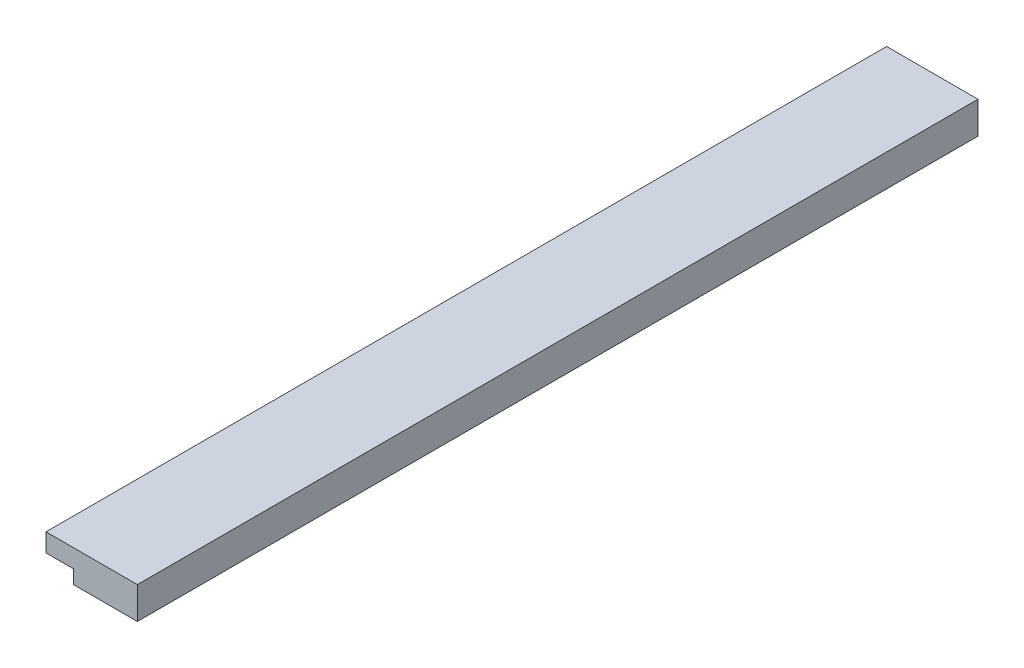
ISO-10303-21;
HEADER;
FILE_DESCRIPTION(('STEP AP214'),'2;1');
FILE_NAME('part.step','',(''),(''),'','','');
FILE_SCHEMA(('AUTOMOTIVE_DESIGN { 1 0 10303 214 1 1 1 1 }'));
ENDSEC;
DATA;
#1=APPLICATION_CONTEXT('core data for automotive mechanical design processes');
#2=APPLICATION_PROTOCOL_DEFINITION('international standard','automotive_design',2000,#1);
#3=PRODUCT_CONTEXT('',#1,'mechanical');
#4=PRODUCT('Part','Part','',(#3));
#5=PRODUCT_RELATED_PRODUCT_CATEGORY('part','',(#4));
#6=PRODUCT_DEFINITION_FORMATION('','',#4);
#7=PRODUCT_DEFINITION_CONTEXT('part definition',#1,'design');
#8=PRODUCT_DEFINITION('design','',#6,#7);
#9=PRODUCT_DEFINITION_SHAPE('','',#8);
#10=(LENGTH_UNIT() NAMED_UNIT(*) SI_UNIT(.MILLI.,.METRE.));
#11=(NAMED_UNIT(*) PLANE_ANGLE_UNIT() SI_UNIT($,.RADIAN.));
#12=(NAMED_UNIT(*) SI_UNIT($,.STERADIAN.) SOLID_ANGLE_UNIT());
#13=UNCERTAINTY_MEASURE_WITH_UNIT(LENGTH_MEASURE(1.E-05),#10,'distance_accuracy_value','');
#14=(GEOMETRIC_REPRESENTATION_CONTEXT(3) GLOBAL_UNCERTAINTY_ASSIGNED_CONTEXT((#13)) GLOBAL_UNIT_ASSIGNED_CONTEXT((#10,
#11,#12)) REPRESENTATION_CONTEXT('',''));
#15=CARTESIAN_POINT('',(0.,0.,0.));
#16=DIRECTION('',(0.,0.,1.));
#17=DIRECTION('',(1.,0.,0.));
#18=AXIS2_PLACEMENT_3D('',#15,#16,#17);
#19=CARTESIAN_POINT('',(5.,3.5,46.));
#20=DIRECTION('',(-1.,0.,0.));
#21=DIRECTION('',(0.,0.,1.));
#22=AXIS2_PLACEMENT_3D('',#19,#20,#21);
#23=PLANE('',#22);
#24=DIRECTION('',(0.,0.,-1.));
#25=VECTOR('',#24,1.);
#26=CARTESIAN_POINT('',(5.,0.,46.));
#27=LINE('',#26,#25);
#28=CARTESIAN_POINT('',(5.,0.,46.));
#29=VERTEX_POINT('',#28);
#30=CARTESIAN_POINT('',(5.,0.,-46.));
#31=VERTEX_POINT('',#30);
#32=EDGE_CURVE('E37',#29,#31,#27,.T.);
#33=ORIENTED_EDGE('',*,*,#32,.T.);
#34=DIRECTION('',(0.,-1.,0.));
#35=VECTOR('',#34,1.);
#36=CARTESIAN_POINT('',(5.,3.5,-46.));
#37=LINE('',#36,#35);
#38=CARTESIAN_POINT('',(5.,3.5,-46.));
#39=VERTEX_POINT('',#38);
#40=EDGE_CURVE('E104',#39,#31,#37,.T.);
#41=ORIENTED_EDGE('',*,*,#40,.F.);
#42=DIRECTION('',(0.,0.,-1.));
#43=VECTOR('',#42,1.);
#44=CARTESIAN_POINT('',(5.,3.5,46.));
#45=LINE('',#44,#43);
#46=CARTESIAN_POINT('',(5.,3.5,46.));
#47=VERTEX_POINT('',#46);
#48=EDGE_CURVE('E94',#47,#39,#45,.T.);
#49=ORIENTED_EDGE('',*,*,#48,.F.);
#50=DIRECTION('',(0.,-1.,0.));
#51=VECTOR('',#50,1.);
#52=CARTESIAN_POINT('',(5.,3.5,46.));
#53=LINE('',#52,#51);
#54=EDGE_CURVE('E44',#47,#29,#53,.T.);
#55=ORIENTED_EDGE('',*,*,#54,.T.);
#56=EDGE_LOOP('',(#33,#41,#49,#55));
#57=FACE_BOUND('',#56,.T.);
#58=ADVANCED_FACE('F33',(#57),#23,.F.);
#59=CARTESIAN_POINT('',(-2.,-7.,43.5));
#60=DIRECTION('',(1.,0.,0.));
#61=DIRECTION('',(0.,0.,-1.));
#62=AXIS2_PLACEMENT_3D('',#59,#60,#61);
#63=PLANE('',#62);
#64=DIRECTION('',(0.,-1.,0.));
#65=VECTOR('',#64,1.);
#66=CARTESIAN_POINT('',(-2.,0.,-46.));
#67=LINE('',#66,#65);
#68=CARTESIAN_POINT('',(-2.,1.5,-46.));
#69=VERTEX_POINT('',#68);
#70=CARTESIAN_POINT('',(-2.,0.,-46.));
#71=VERTEX_POINT('',#70);
#72=EDGE_CURVE('E127',#69,#71,#67,.T.);
#73=ORIENTED_EDGE('',*,*,#72,.T.);
#74=DIRECTION('',(0.,0.,-1.));
#75=VECTOR('',#74,1.);
#76=CARTESIAN_POINT('',(-2.,0.,46.));
#77=LINE('',#76,#75);
#78=CARTESIAN_POINT('',(-2.,0.,46.));
#79=VERTEX_POINT('',#78);
#80=EDGE_CURVE('E75',#79,#71,#77,.T.);
#81=ORIENTED_EDGE('',*,*,#80,.F.);
#82=DIRECTION('',(0.,-1.,0.));
#83=VECTOR('',#82,1.);
#84=CARTESIAN_POINT('',(-2.,0.,46.));
#85=LINE('',#84,#83);
#86=CARTESIAN_POINT('',(-2.,1.5,46.));
#87=VERTEX_POINT('',#86);
#88=EDGE_CURVE('E134',#87,#79,#85,.T.);
#89=ORIENTED_EDGE('',*,*,#88,.F.);
#90=DIRECTION('',(0.,0.,-1.));
#91=VECTOR('',#90,1.);
#92=CARTESIAN_POINT('',(-2.,1.5,46.));
#93=LINE('',#92,#91);
#94=EDGE_CURVE('E125',#87,#69,#93,.T.);
#95=ORIENTED_EDGE('',*,*,#94,.T.);
#96=EDGE_LOOP('',(#73,#81,#89,#95));
#97=FACE_BOUND('',#96,.T.);
#98=ADVANCED_FACE('F128',(#97),#63,.F.);
#99=CARTESIAN_POINT('',(0.,0.,0.));
#100=DIRECTION('',(0.,-1.,0.));
#101=DIRECTION('',(0.,0.,-1.));
#102=AXIS2_PLACEMENT_3D('',#99,#100,#101);
#103=PLANE('',#102);
#104=ORIENTED_EDGE('',*,*,#80,.T.);
#105=DIRECTION('',(-1.,0.,0.));
#106=VECTOR('',#105,1.);
#107=CARTESIAN_POINT('',(-5.,0.,-46.));
#108=LINE('',#107,#106);
#109=EDGE_CURVE('E114',#31,#71,#108,.T.);
#110=ORIENTED_EDGE('',*,*,#109,.F.);
#111=ORIENTED_EDGE('',*,*,#32,.F.);
#112=DIRECTION('',(1.,0.,0.));
#113=VECTOR('',#112,1.);
#114=CARTESIAN_POINT('',(-5.,0.,46.));
#115=LINE('',#114,#113);
#116=EDGE_CURVE('E64',#79,#29,#115,.T.);
#117=ORIENTED_EDGE('',*,*,#116,.F.);
#118=EDGE_LOOP('',(#104,#110,#111,#117));
#119=FACE_BOUND('',#118,.T.);
#120=ADVANCED_FACE('F124',(#119),#103,.T.);
#121=CARTESIAN_POINT('',(-5.,3.5,46.));
#122=DIRECTION('',(1.,0.,0.));
#123=DIRECTION('',(0.,0.,-1.));
#124=AXIS2_PLACEMENT_3D('',#121,#122,#123);
#125=PLANE('',#124);
#126=DIRECTION('',(0.,-1.,0.));
#127=VECTOR('',#126,1.);
#128=CARTESIAN_POINT('',(-5.,3.5,-46.));
#129=LINE('',#128,#127);
#130=CARTESIAN_POINT('',(-5.,3.5,-46.));
#131=VERTEX_POINT('',#130);
#132=CARTESIAN_POINT('',(-5.,1.5,-46.));
#133=VERTEX_POINT('',#132);
#134=EDGE_CURVE('E108',#131,#133,#129,.T.);
#135=ORIENTED_EDGE('',*,*,#134,.T.);
#136=DIRECTION('',(0.,0.,-1.));
#137=VECTOR('',#136,1.);
#138=CARTESIAN_POINT('',(-5.,1.5,46.));
#139=LINE('',#138,#137);
#140=CARTESIAN_POINT('',(-5.,1.5,46.));
#141=VERTEX_POINT('',#140);
#142=EDGE_CURVE('E140',#141,#133,#139,.T.);
#143=ORIENTED_EDGE('',*,*,#142,.F.);
#144=DIRECTION('',(0.,-1.,0.));
#145=VECTOR('',#144,1.);
#146=CARTESIAN_POINT('',(-5.,3.5,46.));
#147=LINE('',#146,#145);
#148=CARTESIAN_POINT('',(-5.,3.5,46.));
#149=VERTEX_POINT('',#148);
#150=EDGE_CURVE('E11',#149,#141,#147,.T.);
#151=ORIENTED_EDGE('',*,*,#150,.F.);
#152=DIRECTION('',(0.,0.,1.));
#153=VECTOR('',#152,1.);
#154=CARTESIAN_POINT('',(-5.,3.5,46.));
#155=LINE('',#154,#153);
#156=EDGE_CURVE('E97',#131,#149,#155,.T.);
#157=ORIENTED_EDGE('',*,*,#156,.F.);
#158=EDGE_LOOP('',(#135,#143,#151,#157));
#159=FACE_BOUND('',#158,.T.);
#160=ADVANCED_FACE('F35',(#159),#125,.F.);
#161=CARTESIAN_POINT('',(-5.,3.5,46.));
#162=DIRECTION('',(0.,0.,-1.));
#163=DIRECTION('',(-1.,0.,0.));
#164=AXIS2_PLACEMENT_3D('',#161,#162,#163);
#165=PLANE('',#164);
#166=DIRECTION('',(1.,0.,0.));
#167=VECTOR('',#166,1.);
#168=CARTESIAN_POINT('',(-5.,1.5,46.));
#169=LINE('',#168,#167);
#170=EDGE_CURVE('E131',#141,#87,#169,.T.);
#171=ORIENTED_EDGE('',*,*,#170,.T.);
#172=ORIENTED_EDGE('',*,*,#88,.T.);
#173=ORIENTED_EDGE('',*,*,#116,.T.);
#174=ORIENTED_EDGE('',*,*,#54,.F.);
#175=DIRECTION('',(1.,0.,0.));
#176=VECTOR('',#175,1.);
#177=CARTESIAN_POINT('',(-5.,3.5,46.));
#178=LINE('',#177,#176);
#179=EDGE_CURVE('E91',#149,#47,#178,.T.);
#180=ORIENTED_EDGE('',*,*,#179,.F.);
#181=ORIENTED_EDGE('',*,*,#150,.T.);
#182=EDGE_LOOP('',(#171,#172,#173,#174,#180,#181));
#183=FACE_BOUND('',#182,.T.);
#184=ADVANCED_FACE('F101',(#183),#165,.F.);
#185=CARTESIAN_POINT('',(-5.,3.5,-46.));
#186=DIRECTION('',(0.,0.,1.));
#187=DIRECTION('',(1.,0.,0.));
#188=AXIS2_PLACEMENT_3D('',#185,#186,#187);
#189=PLANE('',#188);
#190=ORIENTED_EDGE('',*,*,#109,.T.);
#191=ORIENTED_EDGE('',*,*,#72,.F.);
#192=DIRECTION('',(1.,0.,0.));
#193=VECTOR('',#192,1.);
#194=CARTESIAN_POINT('',(-5.,1.5,-46.));
#195=LINE('',#194,#193);
#196=EDGE_CURVE('E132',#133,#69,#195,.T.);
#197=ORIENTED_EDGE('',*,*,#196,.F.);
#198=ORIENTED_EDGE('',*,*,#134,.F.);
#199=DIRECTION('',(-1.,0.,0.));
#200=VECTOR('',#199,1.);
#201=CARTESIAN_POINT('',(-5.,3.5,-46.));
#202=LINE('',#201,#200);
#203=EDGE_CURVE('E52',#39,#131,#202,.T.);
#204=ORIENTED_EDGE('',*,*,#203,.F.);
#205=ORIENTED_EDGE('',*,*,#40,.T.);
#206=EDGE_LOOP('',(#190,#191,#197,#198,#204,#205));
#207=FACE_BOUND('',#206,.T.);
#208=ADVANCED_FACE('F121',(#207),#189,.F.);
#209=CARTESIAN_POINT('',(0.,3.5,0.));
#210=DIRECTION('',(0.,-1.,0.));
#211=DIRECTION('',(0.,0.,-1.));
#212=AXIS2_PLACEMENT_3D('',#209,#210,#211);
#213=PLANE('',#212);
#214=ORIENTED_EDGE('',*,*,#156,.T.);
#215=ORIENTED_EDGE('',*,*,#179,.T.);
#216=ORIENTED_EDGE('',*,*,#48,.T.);
#217=ORIENTED_EDGE('',*,*,#203,.T.);
#218=EDGE_LOOP('',(#214,#215,#216,#217));
#219=FACE_BOUND('',#218,.T.);
#220=ADVANCED_FACE('F92',(#219),#213,.F.);
#221=CARTESIAN_POINT('',(-5.,1.5,46.));
#222=DIRECTION('',(0.,1.,0.));
#223=DIRECTION('',(-1.,0.,0.));
#224=AXIS2_PLACEMENT_3D('',#221,#222,#223);
#225=PLANE('',#224);
#226=ORIENTED_EDGE('',*,*,#196,.T.);
#227=ORIENTED_EDGE('',*,*,#94,.F.);
#228=ORIENTED_EDGE('',*,*,#170,.F.);
#229=ORIENTED_EDGE('',*,*,#142,.T.);
#230=EDGE_LOOP('',(#226,#227,#228,#229));
#231=FACE_BOUND('',#230,.T.);
#232=ADVANCED_FACE('F144',(#231),#225,.F.);
#233=CLOSED_SHELL('',(#58,#98,#120,#160,#184,#208,#220,#232));
#234=MANIFOLD_SOLID_BREP('B2',#233);
#235=ADVANCED_BREP_SHAPE_REPRESENTATION('',(#18,#234),#14);
#236=SHAPE_DEFINITION_REPRESENTATION(#9,#235);
ENDSEC;
END-ISO-10303-21;
